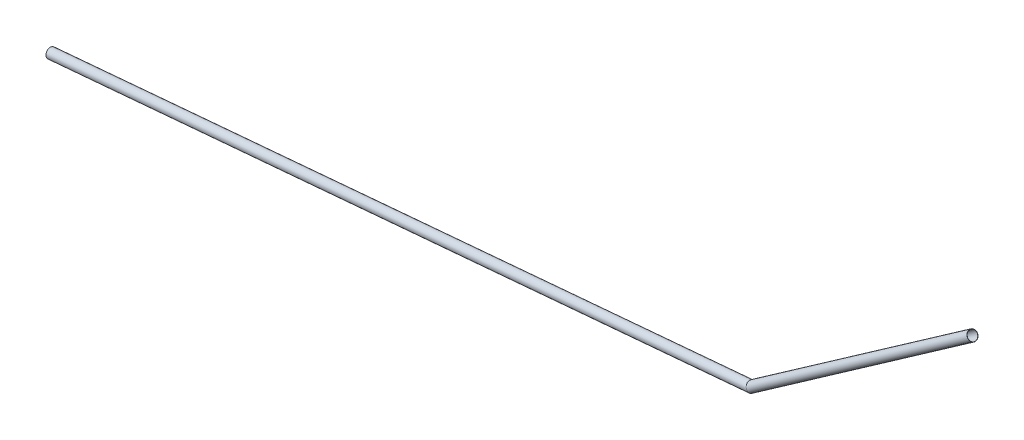
ISO-10303-21;
HEADER;
FILE_DESCRIPTION(('STEP AP214'),'2;1');
FILE_NAME('part.step','',(''),(''),'','','');
FILE_SCHEMA(('AUTOMOTIVE_DESIGN { 1 0 10303 214 1 1 1 1 }'));
ENDSEC;
DATA;
#1=APPLICATION_CONTEXT('core data for automotive mechanical design processes');
#2=APPLICATION_PROTOCOL_DEFINITION('international standard','automotive_design',2000,#1);
#3=PRODUCT_CONTEXT('',#1,'mechanical');
#4=PRODUCT('Part','Part','',(#3));
#5=PRODUCT_RELATED_PRODUCT_CATEGORY('part','',(#4));
#6=PRODUCT_DEFINITION_FORMATION('','',#4);
#7=PRODUCT_DEFINITION_CONTEXT('part definition',#1,'design');
#8=PRODUCT_DEFINITION('design','',#6,#7);
#9=PRODUCT_DEFINITION_SHAPE('','',#8);
#10=(LENGTH_UNIT() NAMED_UNIT(*) SI_UNIT(.MILLI.,.METRE.));
#11=(NAMED_UNIT(*) PLANE_ANGLE_UNIT() SI_UNIT($,.RADIAN.));
#12=(NAMED_UNIT(*) SI_UNIT($,.STERADIAN.) SOLID_ANGLE_UNIT());
#13=UNCERTAINTY_MEASURE_WITH_UNIT(LENGTH_MEASURE(1.E-05),#10,'distance_accuracy_value','');
#14=(GEOMETRIC_REPRESENTATION_CONTEXT(3) GLOBAL_UNCERTAINTY_ASSIGNED_CONTEXT((#13)) GLOBAL_UNIT_ASSIGNED_CONTEXT((#10,
#11,#12)) REPRESENTATION_CONTEXT('',''));
#15=CARTESIAN_POINT('',(0.,0.,0.));
#16=DIRECTION('',(0.,0.,1.));
#17=DIRECTION('',(1.,0.,0.));
#18=AXIS2_PLACEMENT_3D('',#15,#16,#17);
#19=CARTESIAN_POINT('',(500.,117.270596725018,0.));
#20=DIRECTION('',(0.819152044288987,0.573576436351053,0.));
#21=DIRECTION('',(-0.573576436351053,0.819152044288987,0.));
#22=AXIS2_PLACEMENT_3D('',#19,#20,#21);
#23=PLANE('',#22);
#24=CARTESIAN_POINT('',(500.,117.270596725018,0.));
#25=DIRECTION('',(0.819152044288987,0.573576436351053,0.));
#26=DIRECTION('',(-0.573576436351053,0.819152044288987,0.));
#27=AXIS2_PLACEMENT_3D('',#24,#25,#26);
#28=CIRCLE('',#27,2.5);
#29=CARTESIAN_POINT('',(498.566058909122,119.31847683574,0.));
#30=VERTEX_POINT('',#29);
#31=EDGE_CURVE('E53',#30,#30,#28,.T.);
#32=ORIENTED_EDGE('',*,*,#31,.F.);
#33=EDGE_LOOP('',(#32));
#34=FACE_BOUND('',#33,.T.);
#35=CARTESIAN_POINT('',(500.,117.270596725018,0.));
#36=DIRECTION('',(0.819152044288987,0.573576436351053,0.));
#37=DIRECTION('',(-0.573576436351053,0.819152044288987,0.));
#38=AXIS2_PLACEMENT_3D('',#35,#36,#37);
#39=CIRCLE('',#38,2.6);
#40=CARTESIAN_POINT('',(498.508701265487,119.400392040169,0.));
#41=VERTEX_POINT('',#40);
#42=EDGE_CURVE('E51',#41,#41,#39,.T.);
#43=ORIENTED_EDGE('',*,*,#42,.T.);
#44=EDGE_LOOP('',(#43));
#45=FACE_BOUND('',#44,.T.);
#46=ADVANCED_FACE('F37',(#34,#45),#23,.T.);
#47=CARTESIAN_POINT('',(0.,0.,0.));
#48=DIRECTION('',(0.996194698091746,0.0871557427476583,0.));
#49=DIRECTION('',(-0.0871557427476583,0.996194698091746,0.));
#50=AXIS2_PLACEMENT_3D('',#47,#48,#49);
#51=PLANE('',#50);
#52=CARTESIAN_POINT('',(0.,0.,0.));
#53=DIRECTION('',(0.996194698091746,0.0871557427476583,0.));
#54=DIRECTION('',(-0.0871557427476583,0.996194698091746,0.));
#55=AXIS2_PLACEMENT_3D('',#52,#53,#54);
#56=CIRCLE('',#55,2.5);
#57=CARTESIAN_POINT('',(-0.217889356869146,2.49048674522936,0.));
#58=VERTEX_POINT('',#57);
#59=EDGE_CURVE('E62',#58,#58,#56,.T.);
#60=ORIENTED_EDGE('',*,*,#59,.T.);
#61=EDGE_LOOP('',(#60));
#62=FACE_BOUND('',#61,.T.);
#63=CARTESIAN_POINT('',(0.,0.,0.));
#64=DIRECTION('',(0.996194698091746,0.0871557427476583,0.));
#65=DIRECTION('',(-0.0871557427476583,0.996194698091746,0.));
#66=AXIS2_PLACEMENT_3D('',#63,#64,#65);
#67=CIRCLE('',#66,2.6);
#68=CARTESIAN_POINT('',(-0.226604931143912,2.59010621503854,0.));
#69=VERTEX_POINT('',#68);
#70=EDGE_CURVE('E41',#69,#69,#67,.T.);
#71=ORIENTED_EDGE('',*,*,#70,.F.);
#72=EDGE_LOOP('',(#71));
#73=FACE_BOUND('',#72,.T.);
#74=ADVANCED_FACE('F77',(#62,#73),#51,.F.);
#75=CARTESIAN_POINT('',(379.314484191521,32.7656888031921,0.));
#76=DIRECTION('',(0.819152044288987,0.573576436351053,0.));
#77=DIRECTION('',(-0.573576436351053,0.819152044288987,0.));
#78=AXIS2_PLACEMENT_3D('',#75,#76,#77);
#79=CYLINDRICAL_SURFACE('',#78,2.6);
#80=CARTESIAN_POINT('',(380.,33.2456921398512,0.));
#81=DIRECTION('',(0.939692620785907,0.342020143325673,0.));
#82=DIRECTION('',(0.342020143325673,-0.939692620785907,0.));
#83=AXIS2_PLACEMENT_3D('',#80,#81,#82);
#84=ELLIPSE('',#83,2.69171806906622,2.6);
#85=CARTESIAN_POINT('',(380.920621799775,30.7163045331136,0.));
#86=VERTEX_POINT('',#85);
#87=EDGE_CURVE('E10',#86,#86,#84,.F.);
#88=ORIENTED_EDGE('',*,*,#87,.F.);
#89=EDGE_LOOP('',(#88));
#90=FACE_BOUND('',#89,.T.);
#91=ORIENTED_EDGE('',*,*,#42,.F.);
#92=EDGE_LOOP('',(#91));
#93=FACE_BOUND('',#92,.T.);
#94=ADVANCED_FACE('F83',(#90,#93),#79,.T.);
#95=CARTESIAN_POINT('',(0.,0.,0.));
#96=DIRECTION('',(0.996194698091746,0.0871557427476583,0.));
#97=DIRECTION('',(-0.0871557427476583,0.996194698091746,0.));
#98=AXIS2_PLACEMENT_3D('',#95,#96,#97);
#99=CYLINDRICAL_SURFACE('',#98,2.6);
#100=ORIENTED_EDGE('',*,*,#70,.T.);
#101=EDGE_LOOP('',(#100));
#102=FACE_BOUND('',#101,.T.);
#103=ORIENTED_EDGE('',*,*,#87,.T.);
#104=EDGE_LOOP('',(#103));
#105=FACE_BOUND('',#104,.T.);
#106=ADVANCED_FACE('F39',(#102,#105),#99,.T.);
#107=CARTESIAN_POINT('',(379.314484191521,32.7656888031921,0.));
#108=DIRECTION('',(0.819152044288987,0.573576436351053,0.));
#109=DIRECTION('',(-0.573576436351053,0.819152044288987,0.));
#110=AXIS2_PLACEMENT_3D('',#107,#108,#109);
#111=CYLINDRICAL_SURFACE('',#110,2.5);
#112=CARTESIAN_POINT('',(380.,33.2456921398512,0.));
#113=DIRECTION('',(0.939692620785907,0.342020143325673,0.));
#114=DIRECTION('',(0.342020143325673,-0.939692620785907,0.));
#115=AXIS2_PLACEMENT_3D('',#112,#113,#114);
#116=ELLIPSE('',#115,2.58819045102521,2.5);
#117=CARTESIAN_POINT('',(380.885213269014,30.8135886718342,0.));
#118=VERTEX_POINT('',#117);
#119=EDGE_CURVE('E57',#118,#118,#116,.F.);
#120=ORIENTED_EDGE('',*,*,#119,.T.);
#121=EDGE_LOOP('',(#120));
#122=FACE_BOUND('',#121,.T.);
#123=ORIENTED_EDGE('',*,*,#31,.T.);
#124=EDGE_LOOP('',(#123));
#125=FACE_BOUND('',#124,.T.);
#126=ADVANCED_FACE('F74',(#122,#125),#111,.F.);
#127=CARTESIAN_POINT('',(0.,0.,0.));
#128=DIRECTION('',(0.996194698091746,0.0871557427476583,0.));
#129=DIRECTION('',(-0.0871557427476583,0.996194698091746,0.));
#130=AXIS2_PLACEMENT_3D('',#127,#128,#129);
#131=CYLINDRICAL_SURFACE('',#130,2.5);
#132=ORIENTED_EDGE('',*,*,#59,.F.);
#133=EDGE_LOOP('',(#132));
#134=FACE_BOUND('',#133,.T.);
#135=ORIENTED_EDGE('',*,*,#119,.F.);
#136=EDGE_LOOP('',(#135));
#137=FACE_BOUND('',#136,.T.);
#138=ADVANCED_FACE('F79',(#134,#137),#131,.F.);
#139=CLOSED_SHELL('',(#46,#74,#94,#106,#126,#138));
#140=MANIFOLD_SOLID_BREP('B2',#139);
#141=ADVANCED_BREP_SHAPE_REPRESENTATION('',(#18,#140),#14);
#142=SHAPE_DEFINITION_REPRESENTATION(#9,#141);
ENDSEC;
END-ISO-10303-21;
